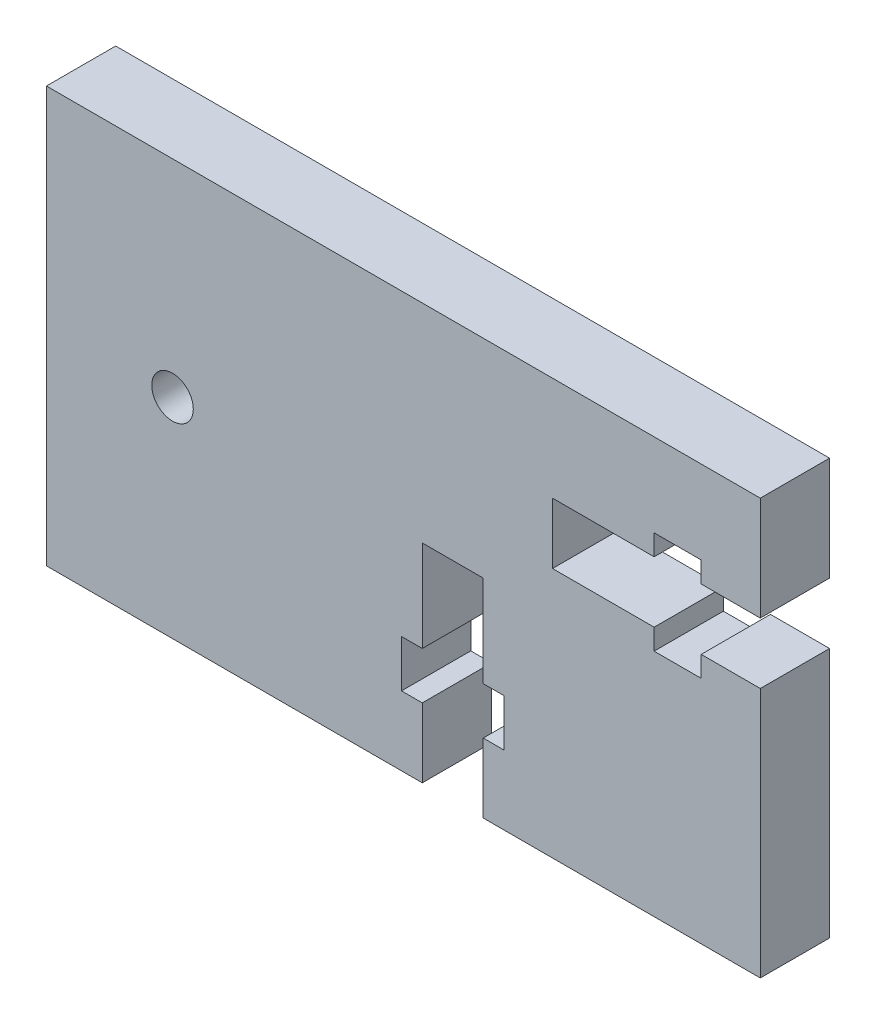
ISO-10303-21;
HEADER;
FILE_DESCRIPTION(('STEP AP214'),'2;1');
FILE_NAME('part.step','',(''),(''),'','','');
FILE_SCHEMA(('AUTOMOTIVE_DESIGN { 1 0 10303 214 1 1 1 1 }'));
ENDSEC;
DATA;
#1=APPLICATION_CONTEXT('core data for automotive mechanical design processes');
#2=APPLICATION_PROTOCOL_DEFINITION('international standard','automotive_design',2000,#1);
#3=PRODUCT_CONTEXT('',#1,'mechanical');
#4=PRODUCT('Part','Part','',(#3));
#5=PRODUCT_RELATED_PRODUCT_CATEGORY('part','',(#4));
#6=PRODUCT_DEFINITION_FORMATION('','',#4);
#7=PRODUCT_DEFINITION_CONTEXT('part definition',#1,'design');
#8=PRODUCT_DEFINITION('design','',#6,#7);
#9=PRODUCT_DEFINITION_SHAPE('','',#8);
#10=(LENGTH_UNIT() NAMED_UNIT(*) SI_UNIT(.MILLI.,.METRE.));
#11=(NAMED_UNIT(*) PLANE_ANGLE_UNIT() SI_UNIT($,.RADIAN.));
#12=(NAMED_UNIT(*) SI_UNIT($,.STERADIAN.) SOLID_ANGLE_UNIT());
#13=UNCERTAINTY_MEASURE_WITH_UNIT(LENGTH_MEASURE(1.E-05),#10,'distance_accuracy_value','');
#14=(GEOMETRIC_REPRESENTATION_CONTEXT(3) GLOBAL_UNCERTAINTY_ASSIGNED_CONTEXT((#13)) GLOBAL_UNIT_ASSIGNED_CONTEXT((#10,
#11,#12)) REPRESENTATION_CONTEXT('',''));
#15=CARTESIAN_POINT('',(0.,0.,0.));
#16=DIRECTION('',(0.,0.,1.));
#17=DIRECTION('',(1.,0.,0.));
#18=AXIS2_PLACEMENT_3D('',#15,#16,#17);
#19=CARTESIAN_POINT('',(-23.,-20.,5.));
#20=DIRECTION('',(0.,1.,0.));
#21=DIRECTION('',(0.,0.,1.));
#22=AXIS2_PLACEMENT_3D('',#19,#20,#21);
#23=PLANE('',#22);
#24=DIRECTION('',(1.,0.,0.));
#25=VECTOR('',#24,1.);
#26=CARTESIAN_POINT('',(-23.,-20.,5.));
#27=LINE('',#26,#25);
#28=CARTESIAN_POINT('',(8.53000000000001,-20.,5.));
#29=VERTEX_POINT('',#28);
#30=CARTESIAN_POINT('',(28.53,-20.,5.));
#31=VERTEX_POINT('',#30);
#32=EDGE_CURVE('E411',#29,#31,#27,.T.);
#33=ORIENTED_EDGE('',*,*,#32,.F.);
#34=DIRECTION('',(0.,0.,1.));
#35=VECTOR('',#34,1.);
#36=CARTESIAN_POINT('',(8.53000000000001,-20.,0.));
#37=LINE('',#36,#35);
#38=CARTESIAN_POINT('',(8.53000000000001,-20.,0.));
#39=VERTEX_POINT('',#38);
#40=EDGE_CURVE('E394',#39,#29,#37,.T.);
#41=ORIENTED_EDGE('',*,*,#40,.F.);
#42=DIRECTION('',(1.,0.,0.));
#43=VECTOR('',#42,1.);
#44=CARTESIAN_POINT('',(-23.,-20.,0.));
#45=LINE('',#44,#43);
#46=CARTESIAN_POINT('',(28.53,-20.,0.));
#47=VERTEX_POINT('',#46);
#48=EDGE_CURVE('E425',#39,#47,#45,.T.);
#49=ORIENTED_EDGE('',*,*,#48,.T.);
#50=DIRECTION('',(0.,0.,-1.));
#51=VECTOR('',#50,1.);
#52=CARTESIAN_POINT('',(28.53,-20.,5.));
#53=LINE('',#52,#51);
#54=EDGE_CURVE('E40',#31,#47,#53,.T.);
#55=ORIENTED_EDGE('',*,*,#54,.F.);
#56=EDGE_LOOP('',(#33,#41,#49,#55));
#57=FACE_BOUND('',#56,.T.);
#58=ADVANCED_FACE('F32',(#57),#23,.F.);
#59=CARTESIAN_POINT('',(28.53,10.,5.));
#60=DIRECTION('',(-1.,0.,0.));
#61=DIRECTION('',(0.,-1.,0.));
#62=AXIS2_PLACEMENT_3D('',#59,#60,#61);
#63=PLANE('',#62);
#64=DIRECTION('',(0.,1.,0.));
#65=VECTOR('',#64,1.);
#66=CARTESIAN_POINT('',(28.53,10.,5.));
#67=LINE('',#66,#65);
#68=CARTESIAN_POINT('',(28.53,2.5,5.));
#69=VERTEX_POINT('',#68);
#70=CARTESIAN_POINT('',(28.53,10.,5.));
#71=VERTEX_POINT('',#70);
#72=EDGE_CURVE('E416',#69,#71,#67,.T.);
#73=ORIENTED_EDGE('',*,*,#72,.F.);
#74=DIRECTION('',(0.,0.,1.));
#75=VECTOR('',#74,1.);
#76=CARTESIAN_POINT('',(28.53,2.5,0.));
#77=LINE('',#76,#75);
#78=CARTESIAN_POINT('',(28.53,2.5,0.));
#79=VERTEX_POINT('',#78);
#80=EDGE_CURVE('E308',#79,#69,#77,.T.);
#81=ORIENTED_EDGE('',*,*,#80,.F.);
#82=DIRECTION('',(0.,1.,0.));
#83=VECTOR('',#82,1.);
#84=CARTESIAN_POINT('',(28.53,10.,0.));
#85=LINE('',#84,#83);
#86=CARTESIAN_POINT('',(28.53,10.,0.));
#87=VERTEX_POINT('',#86);
#88=EDGE_CURVE('E429',#79,#87,#85,.T.);
#89=ORIENTED_EDGE('',*,*,#88,.T.);
#90=DIRECTION('',(0.,0.,-1.));
#91=VECTOR('',#90,1.);
#92=CARTESIAN_POINT('',(28.53,10.,5.));
#93=LINE('',#92,#91);
#94=EDGE_CURVE('E436',#71,#87,#93,.T.);
#95=ORIENTED_EDGE('',*,*,#94,.F.);
#96=EDGE_LOOP('',(#73,#81,#89,#95));
#97=FACE_BOUND('',#96,.T.);
#98=ADVANCED_FACE('F510',(#97),#63,.F.);
#99=CARTESIAN_POINT('',(-23.,10.,5.));
#100=DIRECTION('',(1.,0.,0.));
#101=DIRECTION('',(0.,1.,0.));
#102=AXIS2_PLACEMENT_3D('',#99,#100,#101);
#103=PLANE('',#102);
#104=DIRECTION('',(0.,-1.,0.));
#105=VECTOR('',#104,1.);
#106=CARTESIAN_POINT('',(-23.,10.,0.));
#107=LINE('',#106,#105);
#108=CARTESIAN_POINT('',(-23.,10.,0.));
#109=VERTEX_POINT('',#108);
#110=CARTESIAN_POINT('',(-23.,-20.,0.));
#111=VERTEX_POINT('',#110);
#112=EDGE_CURVE('E299',#109,#111,#107,.T.);
#113=ORIENTED_EDGE('',*,*,#112,.T.);
#114=DIRECTION('',(0.,0.,-1.));
#115=VECTOR('',#114,1.);
#116=CARTESIAN_POINT('',(-23.,-20.,5.));
#117=LINE('',#116,#115);
#118=CARTESIAN_POINT('',(-23.,-20.,5.));
#119=VERTEX_POINT('',#118);
#120=EDGE_CURVE('E11',#119,#111,#117,.T.);
#121=ORIENTED_EDGE('',*,*,#120,.F.);
#122=DIRECTION('',(0.,-1.,0.));
#123=VECTOR('',#122,1.);
#124=CARTESIAN_POINT('',(-23.,10.,5.));
#125=LINE('',#124,#123);
#126=CARTESIAN_POINT('',(-23.,10.,5.));
#127=VERTEX_POINT('',#126);
#128=EDGE_CURVE('E408',#127,#119,#125,.T.);
#129=ORIENTED_EDGE('',*,*,#128,.F.);
#130=DIRECTION('',(0.,0.,-1.));
#131=VECTOR('',#130,1.);
#132=CARTESIAN_POINT('',(-23.,10.,5.));
#133=LINE('',#132,#131);
#134=EDGE_CURVE('E422',#127,#109,#133,.T.);
#135=ORIENTED_EDGE('',*,*,#134,.T.);
#136=EDGE_LOOP('',(#113,#121,#129,#135));
#137=FACE_BOUND('',#136,.T.);
#138=ADVANCED_FACE('F34',(#137),#103,.F.);
#139=CARTESIAN_POINT('',(4.13000000000001,-20.,0.));
#140=VERTEX_POINT('',#139);
#141=EDGE_CURVE('E426',#111,#140,#45,.T.);
#142=ORIENTED_EDGE('',*,*,#141,.T.);
#143=DIRECTION('',(0.,0.,1.));
#144=VECTOR('',#143,1.);
#145=CARTESIAN_POINT('',(4.13000000000001,-20.,0.));
#146=LINE('',#145,#144);
#147=CARTESIAN_POINT('',(4.13000000000001,-20.,5.));
#148=VERTEX_POINT('',#147);
#149=EDGE_CURVE('E396',#140,#148,#146,.T.);
#150=ORIENTED_EDGE('',*,*,#149,.T.);
#151=EDGE_CURVE('E413',#119,#148,#27,.T.);
#152=ORIENTED_EDGE('',*,*,#151,.F.);
#153=ORIENTED_EDGE('',*,*,#120,.T.);
#154=EDGE_LOOP('',(#142,#150,#152,#153));
#155=FACE_BOUND('',#154,.T.);
#156=ADVANCED_FACE('F498',(#155),#23,.F.);
#157=CARTESIAN_POINT('',(28.53,-1.9,0.));
#158=VERTEX_POINT('',#157);
#159=EDGE_CURVE('E430',#47,#158,#85,.T.);
#160=ORIENTED_EDGE('',*,*,#159,.T.);
#161=DIRECTION('',(0.,0.,1.));
#162=VECTOR('',#161,1.);
#163=CARTESIAN_POINT('',(28.53,-1.9,0.));
#164=LINE('',#163,#162);
#165=CARTESIAN_POINT('',(28.53,-1.9,5.));
#166=VERTEX_POINT('',#165);
#167=EDGE_CURVE('E310',#158,#166,#164,.T.);
#168=ORIENTED_EDGE('',*,*,#167,.T.);
#169=EDGE_CURVE('E417',#31,#166,#67,.T.);
#170=ORIENTED_EDGE('',*,*,#169,.F.);
#171=ORIENTED_EDGE('',*,*,#54,.T.);
#172=EDGE_LOOP('',(#160,#168,#170,#171));
#173=FACE_BOUND('',#172,.T.);
#174=ADVANCED_FACE('F443',(#173),#63,.F.);
#175=CARTESIAN_POINT('',(-23.,10.,5.));
#176=DIRECTION('',(0.,-1.,0.));
#177=DIRECTION('',(1.,0.,0.));
#178=AXIS2_PLACEMENT_3D('',#175,#176,#177);
#179=PLANE('',#178);
#180=DIRECTION('',(-1.,0.,0.));
#181=VECTOR('',#180,1.);
#182=CARTESIAN_POINT('',(-23.,10.,0.));
#183=LINE('',#182,#181);
#184=EDGE_CURVE('E412',#87,#109,#183,.T.);
#185=ORIENTED_EDGE('',*,*,#184,.T.);
#186=ORIENTED_EDGE('',*,*,#134,.F.);
#187=DIRECTION('',(-1.,0.,0.));
#188=VECTOR('',#187,1.);
#189=CARTESIAN_POINT('',(-23.,10.,5.));
#190=LINE('',#189,#188);
#191=EDGE_CURVE('E420',#71,#127,#190,.T.);
#192=ORIENTED_EDGE('',*,*,#191,.F.);
#193=ORIENTED_EDGE('',*,*,#94,.T.);
#194=EDGE_LOOP('',(#185,#186,#192,#193));
#195=FACE_BOUND('',#194,.T.);
#196=ADVANCED_FACE('F505',(#195),#179,.F.);
#197=CARTESIAN_POINT('',(0.,0.,5.));
#198=DIRECTION('',(0.,0.,1.));
#199=DIRECTION('',(1.,0.,0.));
#200=AXIS2_PLACEMENT_3D('',#197,#198,#199);
#201=PLANE('',#200);
#202=CARTESIAN_POINT('',(-13.8996163089437,-4.90362405937177,5.));
#203=DIRECTION('',(0.,0.,1.));
#204=DIRECTION('',(1.,0.,0.));
#205=AXIS2_PLACEMENT_3D('',#202,#203,#204);
#206=CIRCLE('',#205,1.5);
#207=CARTESIAN_POINT('',(-12.3996163089437,-4.90362405937177,5.));
#208=VERTEX_POINT('',#207);
#209=EDGE_CURVE('E246',#208,#208,#206,.T.);
#210=ORIENTED_EDGE('',*,*,#209,.F.);
#211=EDGE_LOOP('',(#210));
#212=FACE_BOUND('',#211,.T.);
#213=DIRECTION('',(-1.,0.,0.));
#214=VECTOR('',#213,1.);
#215=CARTESIAN_POINT('',(28.53,2.5,5.));
#216=LINE('',#215,#214);
#217=CARTESIAN_POINT('',(24.2659048732177,2.5,5.));
#218=VERTEX_POINT('',#217);
#219=EDGE_CURVE('E286',#69,#218,#216,.T.);
#220=ORIENTED_EDGE('',*,*,#219,.F.);
#221=ORIENTED_EDGE('',*,*,#72,.T.);
#222=ORIENTED_EDGE('',*,*,#191,.T.);
#223=ORIENTED_EDGE('',*,*,#128,.T.);
#224=ORIENTED_EDGE('',*,*,#151,.T.);
#225=DIRECTION('',(0.,-1.,0.));
#226=VECTOR('',#225,1.);
#227=CARTESIAN_POINT('',(4.13000000000001,-15.,5.));
#228=LINE('',#227,#226);
#229=CARTESIAN_POINT('',(4.13000000000001,-15.,5.));
#230=VERTEX_POINT('',#229);
#231=EDGE_CURVE('E369',#230,#148,#228,.T.);
#232=ORIENTED_EDGE('',*,*,#231,.F.);
#233=DIRECTION('',(1.,0.,0.));
#234=VECTOR('',#233,1.);
#235=CARTESIAN_POINT('',(2.63000000000001,-15.,5.));
#236=LINE('',#235,#234);
#237=CARTESIAN_POINT('',(2.63000000000001,-15.,5.));
#238=VERTEX_POINT('',#237);
#239=EDGE_CURVE('E366',#238,#230,#236,.T.);
#240=ORIENTED_EDGE('',*,*,#239,.F.);
#241=DIRECTION('',(0.,-1.,0.));
#242=VECTOR('',#241,1.);
#243=CARTESIAN_POINT('',(2.63,-11.6,5.));
#244=LINE('',#243,#242);
#245=CARTESIAN_POINT('',(2.63,-11.6,5.));
#246=VERTEX_POINT('',#245);
#247=EDGE_CURVE('E363',#246,#238,#244,.T.);
#248=ORIENTED_EDGE('',*,*,#247,.F.);
#249=DIRECTION('',(-1.,0.,0.));
#250=VECTOR('',#249,1.);
#251=CARTESIAN_POINT('',(4.13000000000001,-11.6,5.));
#252=LINE('',#251,#250);
#253=CARTESIAN_POINT('',(4.13000000000001,-11.6,5.));
#254=VERTEX_POINT('',#253);
#255=EDGE_CURVE('E360',#254,#246,#252,.T.);
#256=ORIENTED_EDGE('',*,*,#255,.F.);
#257=DIRECTION('',(0.,-1.,0.));
#258=VECTOR('',#257,1.);
#259=CARTESIAN_POINT('',(4.13000000000001,-5.,5.));
#260=LINE('',#259,#258);
#261=CARTESIAN_POINT('',(4.13000000000001,-5.,5.));
#262=VERTEX_POINT('',#261);
#263=EDGE_CURVE('E356',#262,#254,#260,.T.);
#264=ORIENTED_EDGE('',*,*,#263,.F.);
#265=DIRECTION('',(-1.,0.,0.));
#266=VECTOR('',#265,1.);
#267=CARTESIAN_POINT('',(4.13000000000001,-5.,5.));
#268=LINE('',#267,#266);
#269=CARTESIAN_POINT('',(8.53000000000001,-5.,5.));
#270=VERTEX_POINT('',#269);
#271=EDGE_CURVE('E353',#270,#262,#268,.T.);
#272=ORIENTED_EDGE('',*,*,#271,.F.);
#273=DIRECTION('',(0.,1.,0.));
#274=VECTOR('',#273,1.);
#275=CARTESIAN_POINT('',(8.53000000000001,-11.6,5.));
#276=LINE('',#275,#274);
#277=CARTESIAN_POINT('',(8.53000000000001,-11.6,5.));
#278=VERTEX_POINT('',#277);
#279=EDGE_CURVE('E324',#278,#270,#276,.T.);
#280=ORIENTED_EDGE('',*,*,#279,.F.);
#281=DIRECTION('',(-1.,0.,0.));
#282=VECTOR('',#281,1.);
#283=CARTESIAN_POINT('',(8.53000000000001,-11.6,5.));
#284=LINE('',#283,#282);
#285=CARTESIAN_POINT('',(10.03,-11.6,5.));
#286=VERTEX_POINT('',#285);
#287=EDGE_CURVE('E380',#286,#278,#284,.T.);
#288=ORIENTED_EDGE('',*,*,#287,.F.);
#289=DIRECTION('',(0.,1.,0.));
#290=VECTOR('',#289,1.);
#291=CARTESIAN_POINT('',(10.03,-11.6,5.));
#292=LINE('',#291,#290);
#293=CARTESIAN_POINT('',(10.03,-15.,5.));
#294=VERTEX_POINT('',#293);
#295=EDGE_CURVE('E377',#294,#286,#292,.T.);
#296=ORIENTED_EDGE('',*,*,#295,.F.);
#297=DIRECTION('',(1.,0.,0.));
#298=VECTOR('',#297,1.);
#299=CARTESIAN_POINT('',(10.03,-15.,5.));
#300=LINE('',#299,#298);
#301=CARTESIAN_POINT('',(8.53000000000001,-15.,5.));
#302=VERTEX_POINT('',#301);
#303=EDGE_CURVE('E374',#302,#294,#300,.T.);
#304=ORIENTED_EDGE('',*,*,#303,.F.);
#305=DIRECTION('',(0.,1.,0.));
#306=VECTOR('',#305,1.);
#307=CARTESIAN_POINT('',(8.53000000000001,-20.,5.));
#308=LINE('',#307,#306);
#309=EDGE_CURVE('E371',#29,#302,#308,.T.);
#310=ORIENTED_EDGE('',*,*,#309,.F.);
#311=ORIENTED_EDGE('',*,*,#32,.T.);
#312=ORIENTED_EDGE('',*,*,#169,.T.);
#313=DIRECTION('',(1.,0.,0.));
#314=VECTOR('',#313,1.);
#315=CARTESIAN_POINT('',(24.2659048732177,-1.9,5.));
#316=LINE('',#315,#314);
#317=CARTESIAN_POINT('',(24.2659048732177,-1.9,5.));
#318=VERTEX_POINT('',#317);
#319=EDGE_CURVE('E284',#318,#166,#316,.T.);
#320=ORIENTED_EDGE('',*,*,#319,.F.);
#321=DIRECTION('',(0.,1.,0.));
#322=VECTOR('',#321,1.);
#323=CARTESIAN_POINT('',(24.2659048732177,-3.4,5.));
#324=LINE('',#323,#322);
#325=CARTESIAN_POINT('',(24.2659048732177,-3.4,5.));
#326=VERTEX_POINT('',#325);
#327=EDGE_CURVE('E281',#326,#318,#324,.T.);
#328=ORIENTED_EDGE('',*,*,#327,.F.);
#329=DIRECTION('',(1.,0.,0.));
#330=VECTOR('',#329,1.);
#331=CARTESIAN_POINT('',(20.8659048732177,-3.4,5.));
#332=LINE('',#331,#330);
#333=CARTESIAN_POINT('',(20.8659048732177,-3.4,5.));
#334=VERTEX_POINT('',#333);
#335=EDGE_CURVE('E278',#334,#326,#332,.T.);
#336=ORIENTED_EDGE('',*,*,#335,.F.);
#337=DIRECTION('',(0.,-1.,0.));
#338=VECTOR('',#337,1.);
#339=CARTESIAN_POINT('',(20.8659048732177,-1.9,5.));
#340=LINE('',#339,#338);
#341=CARTESIAN_POINT('',(20.8659048732177,-1.9,5.));
#342=VERTEX_POINT('',#341);
#343=EDGE_CURVE('E275',#342,#334,#340,.T.);
#344=ORIENTED_EDGE('',*,*,#343,.F.);
#345=DIRECTION('',(1.,0.,0.));
#346=VECTOR('',#345,1.);
#347=CARTESIAN_POINT('',(13.53,-1.9,5.));
#348=LINE('',#347,#346);
#349=CARTESIAN_POINT('',(13.53,-1.9,5.));
#350=VERTEX_POINT('',#349);
#351=EDGE_CURVE('E272',#350,#342,#348,.T.);
#352=ORIENTED_EDGE('',*,*,#351,.F.);
#353=DIRECTION('',(0.,-1.,0.));
#354=VECTOR('',#353,1.);
#355=CARTESIAN_POINT('',(13.53,-1.9,5.));
#356=LINE('',#355,#354);
#357=CARTESIAN_POINT('',(13.53,2.5,5.));
#358=VERTEX_POINT('',#357);
#359=EDGE_CURVE('E224',#358,#350,#356,.T.);
#360=ORIENTED_EDGE('',*,*,#359,.F.);
#361=DIRECTION('',(-1.,0.,0.));
#362=VECTOR('',#361,1.);
#363=CARTESIAN_POINT('',(20.8659048732177,2.5,5.));
#364=LINE('',#363,#362);
#365=CARTESIAN_POINT('',(20.8659048732177,2.5,5.));
#366=VERTEX_POINT('',#365);
#367=EDGE_CURVE('E240',#366,#358,#364,.T.);
#368=ORIENTED_EDGE('',*,*,#367,.F.);
#369=DIRECTION('',(0.,-1.,0.));
#370=VECTOR('',#369,1.);
#371=CARTESIAN_POINT('',(20.8659048732177,2.5,5.));
#372=LINE('',#371,#370);
#373=CARTESIAN_POINT('',(20.8659048732177,4.,5.));
#374=VERTEX_POINT('',#373);
#375=EDGE_CURVE('E243',#374,#366,#372,.T.);
#376=ORIENTED_EDGE('',*,*,#375,.F.);
#377=DIRECTION('',(-1.,0.,0.));
#378=VECTOR('',#377,1.);
#379=CARTESIAN_POINT('',(20.8659048732177,4.,5.));
#380=LINE('',#379,#378);
#381=CARTESIAN_POINT('',(24.2659048732177,4.00000000000001,5.));
#382=VERTEX_POINT('',#381);
#383=EDGE_CURVE('E292',#382,#374,#380,.T.);
#384=ORIENTED_EDGE('',*,*,#383,.F.);
#385=DIRECTION('',(0.,1.,0.));
#386=VECTOR('',#385,1.);
#387=CARTESIAN_POINT('',(24.2659048732177,4.00000000000001,5.));
#388=LINE('',#387,#386);
#389=EDGE_CURVE('E289',#218,#382,#388,.T.);
#390=ORIENTED_EDGE('',*,*,#389,.F.);
#391=EDGE_LOOP('',(#220,#221,#222,#223,#224,#232,#240,#248,#256,#264,#272,#280,#288,#296,#304,
#310,#311,#312,#320,#328,#336,#344,#352,#360,#368,#376,#384,#390));
#392=FACE_BOUND('',#391,.T.);
#393=ADVANCED_FACE('F454',(#212,#392),#201,.T.);
#394=CARTESIAN_POINT('',(0.,0.,0.));
#395=DIRECTION('',(0.,0.,1.));
#396=DIRECTION('',(1.,0.,0.));
#397=AXIS2_PLACEMENT_3D('',#394,#395,#396);
#398=PLANE('',#397);
#399=CARTESIAN_POINT('',(-13.8996163089437,-4.90362405937177,0.));
#400=DIRECTION('',(0.,0.,1.));
#401=DIRECTION('',(1.,0.,0.));
#402=AXIS2_PLACEMENT_3D('',#399,#400,#401);
#403=CIRCLE('',#402,1.5);
#404=CARTESIAN_POINT('',(-12.3996163089437,-4.90362405937177,0.));
#405=VERTEX_POINT('',#404);
#406=EDGE_CURVE('E357',#405,#405,#403,.T.);
#407=ORIENTED_EDGE('',*,*,#406,.T.);
#408=EDGE_LOOP('',(#407));
#409=FACE_BOUND('',#408,.T.);
#410=ORIENTED_EDGE('',*,*,#88,.F.);
#411=DIRECTION('',(-1.,0.,0.));
#412=VECTOR('',#411,1.);
#413=CARTESIAN_POINT('',(28.53,2.5,0.));
#414=LINE('',#413,#412);
#415=CARTESIAN_POINT('',(24.2659048732177,2.5,0.));
#416=VERTEX_POINT('',#415);
#417=EDGE_CURVE('E259',#79,#416,#414,.T.);
#418=ORIENTED_EDGE('',*,*,#417,.T.);
#419=DIRECTION('',(0.,1.,0.));
#420=VECTOR('',#419,1.);
#421=CARTESIAN_POINT('',(24.2659048732177,4.00000000000001,0.));
#422=LINE('',#421,#420);
#423=CARTESIAN_POINT('',(24.2659048732177,4.00000000000001,0.));
#424=VERTEX_POINT('',#423);
#425=EDGE_CURVE('E262',#416,#424,#422,.T.);
#426=ORIENTED_EDGE('',*,*,#425,.T.);
#427=DIRECTION('',(-1.,0.,0.));
#428=VECTOR('',#427,1.);
#429=CARTESIAN_POINT('',(20.8659048732177,4.,0.));
#430=LINE('',#429,#428);
#431=CARTESIAN_POINT('',(20.8659048732177,4.,0.));
#432=VERTEX_POINT('',#431);
#433=EDGE_CURVE('E265',#424,#432,#430,.T.);
#434=ORIENTED_EDGE('',*,*,#433,.T.);
#435=DIRECTION('',(0.,-1.,0.));
#436=VECTOR('',#435,1.);
#437=CARTESIAN_POINT('',(20.8659048732177,2.5,0.));
#438=LINE('',#437,#436);
#439=CARTESIAN_POINT('',(20.8659048732177,2.5,0.));
#440=VERTEX_POINT('',#439);
#441=EDGE_CURVE('E268',#432,#440,#438,.T.);
#442=ORIENTED_EDGE('',*,*,#441,.T.);
#443=DIRECTION('',(-1.,0.,0.));
#444=VECTOR('',#443,1.);
#445=CARTESIAN_POINT('',(20.8659048732177,2.5,0.));
#446=LINE('',#445,#444);
#447=CARTESIAN_POINT('',(13.53,2.5,0.));
#448=VERTEX_POINT('',#447);
#449=EDGE_CURVE('E229',#440,#448,#446,.T.);
#450=ORIENTED_EDGE('',*,*,#449,.T.);
#451=DIRECTION('',(0.,-1.,0.));
#452=VECTOR('',#451,1.);
#453=CARTESIAN_POINT('',(13.53,-1.9,0.));
#454=LINE('',#453,#452);
#455=CARTESIAN_POINT('',(13.53,-1.9,0.));
#456=VERTEX_POINT('',#455);
#457=EDGE_CURVE('E221',#448,#456,#454,.T.);
#458=ORIENTED_EDGE('',*,*,#457,.T.);
#459=DIRECTION('',(1.,0.,0.));
#460=VECTOR('',#459,1.);
#461=CARTESIAN_POINT('',(13.53,-1.9,0.));
#462=LINE('',#461,#460);
#463=CARTESIAN_POINT('',(20.8659048732177,-1.9,0.));
#464=VERTEX_POINT('',#463);
#465=EDGE_CURVE('E232',#456,#464,#462,.T.);
#466=ORIENTED_EDGE('',*,*,#465,.T.);
#467=DIRECTION('',(0.,-1.,0.));
#468=VECTOR('',#467,1.);
#469=CARTESIAN_POINT('',(20.8659048732177,-1.9,0.));
#470=LINE('',#469,#468);
#471=CARTESIAN_POINT('',(20.8659048732177,-3.4,0.));
#472=VERTEX_POINT('',#471);
#473=EDGE_CURVE('E47',#464,#472,#470,.T.);
#474=ORIENTED_EDGE('',*,*,#473,.T.);
#475=DIRECTION('',(1.,0.,0.));
#476=VECTOR('',#475,1.);
#477=CARTESIAN_POINT('',(20.8659048732177,-3.4,0.));
#478=LINE('',#477,#476);
#479=CARTESIAN_POINT('',(24.2659048732177,-3.4,0.));
#480=VERTEX_POINT('',#479);
#481=EDGE_CURVE('E250',#472,#480,#478,.T.);
#482=ORIENTED_EDGE('',*,*,#481,.T.);
#483=DIRECTION('',(0.,1.,0.));
#484=VECTOR('',#483,1.);
#485=CARTESIAN_POINT('',(24.2659048732177,-3.4,0.));
#486=LINE('',#485,#484);
#487=CARTESIAN_POINT('',(24.2659048732177,-1.9,0.));
#488=VERTEX_POINT('',#487);
#489=EDGE_CURVE('E253',#480,#488,#486,.T.);
#490=ORIENTED_EDGE('',*,*,#489,.T.);
#491=DIRECTION('',(1.,0.,0.));
#492=VECTOR('',#491,1.);
#493=CARTESIAN_POINT('',(24.2659048732177,-1.9,0.));
#494=LINE('',#493,#492);
#495=EDGE_CURVE('E256',#488,#158,#494,.T.);
#496=ORIENTED_EDGE('',*,*,#495,.T.);
#497=ORIENTED_EDGE('',*,*,#159,.F.);
#498=ORIENTED_EDGE('',*,*,#48,.F.);
#499=DIRECTION('',(0.,1.,0.));
#500=VECTOR('',#499,1.);
#501=CARTESIAN_POINT('',(8.53000000000001,-20.,0.));
#502=LINE('',#501,#500);
#503=CARTESIAN_POINT('',(8.53000000000001,-15.,0.));
#504=VERTEX_POINT('',#503);
#505=EDGE_CURVE('E337',#39,#504,#502,.T.);
#506=ORIENTED_EDGE('',*,*,#505,.T.);
#507=DIRECTION('',(1.,0.,0.));
#508=VECTOR('',#507,1.);
#509=CARTESIAN_POINT('',(10.03,-15.,0.));
#510=LINE('',#509,#508);
#511=CARTESIAN_POINT('',(10.03,-15.,0.));
#512=VERTEX_POINT('',#511);
#513=EDGE_CURVE('E340',#504,#512,#510,.T.);
#514=ORIENTED_EDGE('',*,*,#513,.T.);
#515=DIRECTION('',(0.,1.,0.));
#516=VECTOR('',#515,1.);
#517=CARTESIAN_POINT('',(10.03,-11.6,0.));
#518=LINE('',#517,#516);
#519=CARTESIAN_POINT('',(10.03,-11.6,0.));
#520=VERTEX_POINT('',#519);
#521=EDGE_CURVE('E343',#512,#520,#518,.T.);
#522=ORIENTED_EDGE('',*,*,#521,.T.);
#523=DIRECTION('',(-1.,0.,0.));
#524=VECTOR('',#523,1.);
#525=CARTESIAN_POINT('',(8.53000000000001,-11.6,0.));
#526=LINE('',#525,#524);
#527=CARTESIAN_POINT('',(8.53000000000001,-11.6,0.));
#528=VERTEX_POINT('',#527);
#529=EDGE_CURVE('E346',#520,#528,#526,.T.);
#530=ORIENTED_EDGE('',*,*,#529,.T.);
#531=DIRECTION('',(0.,1.,0.));
#532=VECTOR('',#531,1.);
#533=CARTESIAN_POINT('',(8.53000000000001,-11.6,0.));
#534=LINE('',#533,#532);
#535=CARTESIAN_POINT('',(8.53000000000001,-5.,0.));
#536=VERTEX_POINT('',#535);
#537=EDGE_CURVE('E349',#528,#536,#534,.T.);
#538=ORIENTED_EDGE('',*,*,#537,.T.);
#539=DIRECTION('',(-1.,0.,0.));
#540=VECTOR('',#539,1.);
#541=CARTESIAN_POINT('',(4.13000000000001,-5.,0.));
#542=LINE('',#541,#540);
#543=CARTESIAN_POINT('',(4.13000000000001,-5.,0.));
#544=VERTEX_POINT('',#543);
#545=EDGE_CURVE('E320',#536,#544,#542,.T.);
#546=ORIENTED_EDGE('',*,*,#545,.T.);
#547=DIRECTION('',(0.,-1.,0.));
#548=VECTOR('',#547,1.);
#549=CARTESIAN_POINT('',(4.13000000000001,-5.,0.));
#550=LINE('',#549,#548);
#551=CARTESIAN_POINT('',(4.13000000000001,-11.6,0.));
#552=VERTEX_POINT('',#551);
#553=EDGE_CURVE('E323',#544,#552,#550,.T.);
#554=ORIENTED_EDGE('',*,*,#553,.T.);
#555=DIRECTION('',(-1.,0.,0.));
#556=VECTOR('',#555,1.);
#557=CARTESIAN_POINT('',(4.13000000000001,-11.6,0.));
#558=LINE('',#557,#556);
#559=CARTESIAN_POINT('',(2.63,-11.6,0.));
#560=VERTEX_POINT('',#559);
#561=EDGE_CURVE('E55',#552,#560,#558,.T.);
#562=ORIENTED_EDGE('',*,*,#561,.T.);
#563=DIRECTION('',(0.,-1.,0.));
#564=VECTOR('',#563,1.);
#565=CARTESIAN_POINT('',(2.63,-11.6,0.));
#566=LINE('',#565,#564);
#567=CARTESIAN_POINT('',(2.63000000000001,-15.,0.));
#568=VERTEX_POINT('',#567);
#569=EDGE_CURVE('E328',#560,#568,#566,.T.);
#570=ORIENTED_EDGE('',*,*,#569,.T.);
#571=DIRECTION('',(1.,0.,0.));
#572=VECTOR('',#571,1.);
#573=CARTESIAN_POINT('',(2.63000000000001,-15.,0.));
#574=LINE('',#573,#572);
#575=CARTESIAN_POINT('',(4.13000000000001,-15.,0.));
#576=VERTEX_POINT('',#575);
#577=EDGE_CURVE('E331',#568,#576,#574,.T.);
#578=ORIENTED_EDGE('',*,*,#577,.T.);
#579=DIRECTION('',(0.,-1.,0.));
#580=VECTOR('',#579,1.);
#581=CARTESIAN_POINT('',(4.13000000000001,-15.,0.));
#582=LINE('',#581,#580);
#583=EDGE_CURVE('E334',#576,#140,#582,.T.);
#584=ORIENTED_EDGE('',*,*,#583,.T.);
#585=ORIENTED_EDGE('',*,*,#141,.F.);
#586=ORIENTED_EDGE('',*,*,#112,.F.);
#587=ORIENTED_EDGE('',*,*,#184,.F.);
#588=EDGE_LOOP('',(#410,#418,#426,#434,#442,#450,#458,#466,#474,#482,#490,#496,#497,#498,#506,
#514,#522,#530,#538,#546,#554,#562,#570,#578,#584,#585,#586,#587));
#589=FACE_BOUND('',#588,.T.);
#590=ADVANCED_FACE('F237',(#409,#589),#398,.F.);
#591=CARTESIAN_POINT('',(4.13000000000001,-5.,0.));
#592=DIRECTION('',(0.,1.,0.));
#593=DIRECTION('',(0.,0.,1.));
#594=AXIS2_PLACEMENT_3D('',#591,#592,#593);
#595=PLANE('',#594);
#596=ORIENTED_EDGE('',*,*,#271,.T.);
#597=DIRECTION('',(0.,0.,1.));
#598=VECTOR('',#597,1.);
#599=CARTESIAN_POINT('',(4.13000000000001,-5.,0.));
#600=LINE('',#599,#598);
#601=EDGE_CURVE('E352',#544,#262,#600,.T.);
#602=ORIENTED_EDGE('',*,*,#601,.F.);
#603=ORIENTED_EDGE('',*,*,#545,.F.);
#604=DIRECTION('',(0.,0.,1.));
#605=VECTOR('',#604,1.);
#606=CARTESIAN_POINT('',(8.53000000000001,-5.,0.));
#607=LINE('',#606,#605);
#608=EDGE_CURVE('E273',#536,#270,#607,.T.);
#609=ORIENTED_EDGE('',*,*,#608,.T.);
#610=EDGE_LOOP('',(#596,#602,#603,#609));
#611=FACE_BOUND('',#610,.T.);
#612=ADVANCED_FACE('F479',(#611),#595,.F.);
#613=CARTESIAN_POINT('',(8.53000000000001,-11.6,0.));
#614=DIRECTION('',(1.,0.,0.));
#615=DIRECTION('',(0.,1.,0.));
#616=AXIS2_PLACEMENT_3D('',#613,#614,#615);
#617=PLANE('',#616);
#618=ORIENTED_EDGE('',*,*,#279,.T.);
#619=ORIENTED_EDGE('',*,*,#608,.F.);
#620=ORIENTED_EDGE('',*,*,#537,.F.);
#621=DIRECTION('',(0.,0.,1.));
#622=VECTOR('',#621,1.);
#623=CARTESIAN_POINT('',(8.53000000000001,-11.6,0.));
#624=LINE('',#623,#622);
#625=EDGE_CURVE('E386',#528,#278,#624,.T.);
#626=ORIENTED_EDGE('',*,*,#625,.T.);
#627=EDGE_LOOP('',(#618,#619,#620,#626));
#628=FACE_BOUND('',#627,.T.);
#629=ADVANCED_FACE('F475',(#628),#617,.F.);
#630=CARTESIAN_POINT('',(8.53000000000001,-11.6,0.));
#631=DIRECTION('',(0.,1.,0.));
#632=DIRECTION('',(0.,0.,1.));
#633=AXIS2_PLACEMENT_3D('',#630,#631,#632);
#634=PLANE('',#633);
#635=ORIENTED_EDGE('',*,*,#287,.T.);
#636=ORIENTED_EDGE('',*,*,#625,.F.);
#637=ORIENTED_EDGE('',*,*,#529,.F.);
#638=DIRECTION('',(0.,0.,1.));
#639=VECTOR('',#638,1.);
#640=CARTESIAN_POINT('',(10.03,-11.6,0.));
#641=LINE('',#640,#639);
#642=EDGE_CURVE('E388',#520,#286,#641,.T.);
#643=ORIENTED_EDGE('',*,*,#642,.T.);
#644=EDGE_LOOP('',(#635,#636,#637,#643));
#645=FACE_BOUND('',#644,.T.);
#646=ADVANCED_FACE('F471',(#645),#634,.F.);
#647=CARTESIAN_POINT('',(10.03,-11.6,0.));
#648=DIRECTION('',(1.,0.,0.));
#649=DIRECTION('',(0.,1.,0.));
#650=AXIS2_PLACEMENT_3D('',#647,#648,#649);
#651=PLANE('',#650);
#652=ORIENTED_EDGE('',*,*,#295,.T.);
#653=ORIENTED_EDGE('',*,*,#642,.F.);
#654=ORIENTED_EDGE('',*,*,#521,.F.);
#655=DIRECTION('',(0.,0.,1.));
#656=VECTOR('',#655,1.);
#657=CARTESIAN_POINT('',(10.03,-15.,0.));
#658=LINE('',#657,#656);
#659=EDGE_CURVE('E390',#512,#294,#658,.T.);
#660=ORIENTED_EDGE('',*,*,#659,.T.);
#661=EDGE_LOOP('',(#652,#653,#654,#660));
#662=FACE_BOUND('',#661,.T.);
#663=ADVANCED_FACE('F467',(#662),#651,.F.);
#664=CARTESIAN_POINT('',(10.03,-15.,0.));
#665=DIRECTION('',(0.,-1.,0.));
#666=DIRECTION('',(0.,0.,-1.));
#667=AXIS2_PLACEMENT_3D('',#664,#665,#666);
#668=PLANE('',#667);
#669=ORIENTED_EDGE('',*,*,#303,.T.);
#670=ORIENTED_EDGE('',*,*,#659,.F.);
#671=ORIENTED_EDGE('',*,*,#513,.F.);
#672=DIRECTION('',(0.,0.,1.));
#673=VECTOR('',#672,1.);
#674=CARTESIAN_POINT('',(8.53000000000001,-15.,0.));
#675=LINE('',#674,#673);
#676=EDGE_CURVE('E392',#504,#302,#675,.T.);
#677=ORIENTED_EDGE('',*,*,#676,.T.);
#678=EDGE_LOOP('',(#669,#670,#671,#677));
#679=FACE_BOUND('',#678,.T.);
#680=ADVANCED_FACE('F464',(#679),#668,.F.);
#681=CARTESIAN_POINT('',(8.53000000000001,-20.,0.));
#682=DIRECTION('',(1.,0.,0.));
#683=DIRECTION('',(0.,0.,-1.));
#684=AXIS2_PLACEMENT_3D('',#681,#682,#683);
#685=PLANE('',#684);
#686=ORIENTED_EDGE('',*,*,#309,.T.);
#687=ORIENTED_EDGE('',*,*,#676,.F.);
#688=ORIENTED_EDGE('',*,*,#505,.F.);
#689=ORIENTED_EDGE('',*,*,#40,.T.);
#690=EDGE_LOOP('',(#686,#687,#688,#689));
#691=FACE_BOUND('',#690,.T.);
#692=ADVANCED_FACE('F460',(#691),#685,.F.);
#693=CARTESIAN_POINT('',(4.13000000000001,-15.,0.));
#694=DIRECTION('',(-1.,0.,0.));
#695=DIRECTION('',(0.,-1.,0.));
#696=AXIS2_PLACEMENT_3D('',#693,#694,#695);
#697=PLANE('',#696);
#698=ORIENTED_EDGE('',*,*,#231,.T.);
#699=ORIENTED_EDGE('',*,*,#149,.F.);
#700=ORIENTED_EDGE('',*,*,#583,.F.);
#701=DIRECTION('',(0.,0.,1.));
#702=VECTOR('',#701,1.);
#703=CARTESIAN_POINT('',(4.13000000000001,-15.,0.));
#704=LINE('',#703,#702);
#705=EDGE_CURVE('E399',#576,#230,#704,.T.);
#706=ORIENTED_EDGE('',*,*,#705,.T.);
#707=EDGE_LOOP('',(#698,#699,#700,#706));
#708=FACE_BOUND('',#707,.T.);
#709=ADVANCED_FACE('F495',(#708),#697,.F.);
#710=CARTESIAN_POINT('',(2.63000000000001,-15.,0.));
#711=DIRECTION('',(0.,-1.,0.));
#712=DIRECTION('',(0.,0.,-1.));
#713=AXIS2_PLACEMENT_3D('',#710,#711,#712);
#714=PLANE('',#713);
#715=ORIENTED_EDGE('',*,*,#239,.T.);
#716=ORIENTED_EDGE('',*,*,#705,.F.);
#717=ORIENTED_EDGE('',*,*,#577,.F.);
#718=DIRECTION('',(0.,0.,1.));
#719=VECTOR('',#718,1.);
#720=CARTESIAN_POINT('',(2.63000000000001,-15.,0.));
#721=LINE('',#720,#719);
#722=EDGE_CURVE('E401',#568,#238,#721,.T.);
#723=ORIENTED_EDGE('',*,*,#722,.T.);
#724=EDGE_LOOP('',(#715,#716,#717,#723));
#725=FACE_BOUND('',#724,.T.);
#726=ADVANCED_FACE('F491',(#725),#714,.F.);
#727=CARTESIAN_POINT('',(2.63,-11.6,0.));
#728=DIRECTION('',(-1.,0.,0.));
#729=DIRECTION('',(0.,-1.,0.));
#730=AXIS2_PLACEMENT_3D('',#727,#728,#729);
#731=PLANE('',#730);
#732=ORIENTED_EDGE('',*,*,#247,.T.);
#733=ORIENTED_EDGE('',*,*,#722,.F.);
#734=ORIENTED_EDGE('',*,*,#569,.F.);
#735=DIRECTION('',(0.,0.,1.));
#736=VECTOR('',#735,1.);
#737=CARTESIAN_POINT('',(2.63,-11.6,0.));
#738=LINE('',#737,#736);
#739=EDGE_CURVE('E403',#560,#246,#738,.T.);
#740=ORIENTED_EDGE('',*,*,#739,.T.);
#741=EDGE_LOOP('',(#732,#733,#734,#740));
#742=FACE_BOUND('',#741,.T.);
#743=ADVANCED_FACE('F487',(#742),#731,.F.);
#744=CARTESIAN_POINT('',(4.13000000000001,-11.6,0.));
#745=DIRECTION('',(0.,1.,0.));
#746=DIRECTION('',(-1.,0.,0.));
#747=AXIS2_PLACEMENT_3D('',#744,#745,#746);
#748=PLANE('',#747);
#749=ORIENTED_EDGE('',*,*,#255,.T.);
#750=ORIENTED_EDGE('',*,*,#739,.F.);
#751=ORIENTED_EDGE('',*,*,#561,.F.);
#752=DIRECTION('',(0.,0.,1.));
#753=VECTOR('',#752,1.);
#754=CARTESIAN_POINT('',(4.13000000000001,-11.6,0.));
#755=LINE('',#754,#753);
#756=EDGE_CURVE('E405',#552,#254,#755,.T.);
#757=ORIENTED_EDGE('',*,*,#756,.T.);
#758=EDGE_LOOP('',(#749,#750,#751,#757));
#759=FACE_BOUND('',#758,.T.);
#760=ADVANCED_FACE('F651',(#759),#748,.F.);
#761=CARTESIAN_POINT('',(4.13000000000001,-5.,0.));
#762=DIRECTION('',(-1.,0.,0.));
#763=DIRECTION('',(0.,-1.,0.));
#764=AXIS2_PLACEMENT_3D('',#761,#762,#763);
#765=PLANE('',#764);
#766=ORIENTED_EDGE('',*,*,#263,.T.);
#767=ORIENTED_EDGE('',*,*,#756,.F.);
#768=ORIENTED_EDGE('',*,*,#553,.F.);
#769=ORIENTED_EDGE('',*,*,#601,.T.);
#770=EDGE_LOOP('',(#766,#767,#768,#769));
#771=FACE_BOUND('',#770,.T.);
#772=ADVANCED_FACE('F483',(#771),#765,.F.);
#773=CARTESIAN_POINT('',(13.53,-1.9,0.));
#774=DIRECTION('',(-1.,0.,0.));
#775=DIRECTION('',(0.,0.,1.));
#776=AXIS2_PLACEMENT_3D('',#773,#774,#775);
#777=PLANE('',#776);
#778=ORIENTED_EDGE('',*,*,#359,.T.);
#779=DIRECTION('',(0.,0.,1.));
#780=VECTOR('',#779,1.);
#781=CARTESIAN_POINT('',(13.53,-1.9,0.));
#782=LINE('',#781,#780);
#783=EDGE_CURVE('E217',#456,#350,#782,.T.);
#784=ORIENTED_EDGE('',*,*,#783,.F.);
#785=ORIENTED_EDGE('',*,*,#457,.F.);
#786=DIRECTION('',(0.,0.,1.));
#787=VECTOR('',#786,1.);
#788=CARTESIAN_POINT('',(13.53,2.5,0.));
#789=LINE('',#788,#787);
#790=EDGE_CURVE('E297',#448,#358,#789,.T.);
#791=ORIENTED_EDGE('',*,*,#790,.T.);
#792=EDGE_LOOP('',(#778,#784,#785,#791));
#793=FACE_BOUND('',#792,.T.);
#794=ADVANCED_FACE('F219',(#793),#777,.F.);
#795=CARTESIAN_POINT('',(20.8659048732177,2.5,0.));
#796=DIRECTION('',(0.,1.,0.));
#797=DIRECTION('',(0.,0.,1.));
#798=AXIS2_PLACEMENT_3D('',#795,#796,#797);
#799=PLANE('',#798);
#800=ORIENTED_EDGE('',*,*,#367,.T.);
#801=ORIENTED_EDGE('',*,*,#790,.F.);
#802=ORIENTED_EDGE('',*,*,#449,.F.);
#803=DIRECTION('',(0.,0.,1.));
#804=VECTOR('',#803,1.);
#805=CARTESIAN_POINT('',(20.8659048732177,2.5,0.));
#806=LINE('',#805,#804);
#807=EDGE_CURVE('E300',#440,#366,#806,.T.);
#808=ORIENTED_EDGE('',*,*,#807,.T.);
#809=EDGE_LOOP('',(#800,#801,#802,#808));
#810=FACE_BOUND('',#809,.T.);
#811=ADVANCED_FACE('F528',(#810),#799,.F.);
#812=CARTESIAN_POINT('',(20.8659048732177,2.5,0.));
#813=DIRECTION('',(-1.,0.,0.));
#814=DIRECTION('',(0.,0.,1.));
#815=AXIS2_PLACEMENT_3D('',#812,#813,#814);
#816=PLANE('',#815);
#817=ORIENTED_EDGE('',*,*,#375,.T.);
#818=ORIENTED_EDGE('',*,*,#807,.F.);
#819=ORIENTED_EDGE('',*,*,#441,.F.);
#820=DIRECTION('',(0.,0.,1.));
#821=VECTOR('',#820,1.);
#822=CARTESIAN_POINT('',(20.8659048732177,4.,0.));
#823=LINE('',#822,#821);
#824=EDGE_CURVE('E302',#432,#374,#823,.T.);
#825=ORIENTED_EDGE('',*,*,#824,.T.);
#826=EDGE_LOOP('',(#817,#818,#819,#825));
#827=FACE_BOUND('',#826,.T.);
#828=ADVANCED_FACE('F525',(#827),#816,.F.);
#829=CARTESIAN_POINT('',(20.8659048732177,4.,0.));
#830=DIRECTION('',(0.,1.,0.));
#831=DIRECTION('',(-1.,0.,0.));
#832=AXIS2_PLACEMENT_3D('',#829,#830,#831);
#833=PLANE('',#832);
#834=ORIENTED_EDGE('',*,*,#383,.T.);
#835=ORIENTED_EDGE('',*,*,#824,.F.);
#836=ORIENTED_EDGE('',*,*,#433,.F.);
#837=DIRECTION('',(0.,0.,1.));
#838=VECTOR('',#837,1.);
#839=CARTESIAN_POINT('',(24.2659048732177,4.00000000000001,0.));
#840=LINE('',#839,#838);
#841=EDGE_CURVE('E304',#424,#382,#840,.T.);
#842=ORIENTED_EDGE('',*,*,#841,.T.);
#843=EDGE_LOOP('',(#834,#835,#836,#842));
#844=FACE_BOUND('',#843,.T.);
#845=ADVANCED_FACE('F523',(#844),#833,.F.);
#846=CARTESIAN_POINT('',(24.2659048732177,4.00000000000001,0.));
#847=DIRECTION('',(1.,0.,0.));
#848=DIRECTION('',(0.,0.,-1.));
#849=AXIS2_PLACEMENT_3D('',#846,#847,#848);
#850=PLANE('',#849);
#851=ORIENTED_EDGE('',*,*,#389,.T.);
#852=ORIENTED_EDGE('',*,*,#841,.F.);
#853=ORIENTED_EDGE('',*,*,#425,.F.);
#854=DIRECTION('',(0.,0.,1.));
#855=VECTOR('',#854,1.);
#856=CARTESIAN_POINT('',(24.2659048732177,2.5,0.));
#857=LINE('',#856,#855);
#858=EDGE_CURVE('E306',#416,#218,#857,.T.);
#859=ORIENTED_EDGE('',*,*,#858,.T.);
#860=EDGE_LOOP('',(#851,#852,#853,#859));
#861=FACE_BOUND('',#860,.T.);
#862=ADVANCED_FACE('F518',(#861),#850,.F.);
#863=CARTESIAN_POINT('',(28.53,2.5,0.));
#864=DIRECTION('',(0.,1.,0.));
#865=DIRECTION('',(0.,0.,1.));
#866=AXIS2_PLACEMENT_3D('',#863,#864,#865);
#867=PLANE('',#866);
#868=ORIENTED_EDGE('',*,*,#219,.T.);
#869=ORIENTED_EDGE('',*,*,#858,.F.);
#870=ORIENTED_EDGE('',*,*,#417,.F.);
#871=ORIENTED_EDGE('',*,*,#80,.T.);
#872=EDGE_LOOP('',(#868,#869,#870,#871));
#873=FACE_BOUND('',#872,.T.);
#874=ADVANCED_FACE('F513',(#873),#867,.F.);
#875=CARTESIAN_POINT('',(24.2659048732177,-1.9,0.));
#876=DIRECTION('',(0.,-1.,0.));
#877=DIRECTION('',(1.,0.,0.));
#878=AXIS2_PLACEMENT_3D('',#875,#876,#877);
#879=PLANE('',#878);
#880=ORIENTED_EDGE('',*,*,#319,.T.);
#881=ORIENTED_EDGE('',*,*,#167,.F.);
#882=ORIENTED_EDGE('',*,*,#495,.F.);
#883=DIRECTION('',(0.,0.,1.));
#884=VECTOR('',#883,1.);
#885=CARTESIAN_POINT('',(24.2659048732177,-1.9,0.));
#886=LINE('',#885,#884);
#887=EDGE_CURVE('E313',#488,#318,#886,.T.);
#888=ORIENTED_EDGE('',*,*,#887,.T.);
#889=EDGE_LOOP('',(#880,#881,#882,#888));
#890=FACE_BOUND('',#889,.T.);
#891=ADVANCED_FACE('F450',(#890),#879,.F.);
#892=CARTESIAN_POINT('',(24.2659048732177,-3.4,0.));
#893=DIRECTION('',(1.,0.,0.));
#894=DIRECTION('',(0.,0.,-1.));
#895=AXIS2_PLACEMENT_3D('',#892,#893,#894);
#896=PLANE('',#895);
#897=ORIENTED_EDGE('',*,*,#327,.T.);
#898=ORIENTED_EDGE('',*,*,#887,.F.);
#899=ORIENTED_EDGE('',*,*,#489,.F.);
#900=DIRECTION('',(0.,0.,1.));
#901=VECTOR('',#900,1.);
#902=CARTESIAN_POINT('',(24.2659048732177,-3.4,0.));
#903=LINE('',#902,#901);
#904=EDGE_CURVE('E315',#480,#326,#903,.T.);
#905=ORIENTED_EDGE('',*,*,#904,.T.);
#906=EDGE_LOOP('',(#897,#898,#899,#905));
#907=FACE_BOUND('',#906,.T.);
#908=ADVANCED_FACE('F536',(#907),#896,.F.);
#909=CARTESIAN_POINT('',(20.8659048732177,-3.4,0.));
#910=DIRECTION('',(0.,-1.,0.));
#911=DIRECTION('',(1.,0.,0.));
#912=AXIS2_PLACEMENT_3D('',#909,#910,#911);
#913=PLANE('',#912);
#914=ORIENTED_EDGE('',*,*,#335,.T.);
#915=ORIENTED_EDGE('',*,*,#904,.F.);
#916=ORIENTED_EDGE('',*,*,#481,.F.);
#917=DIRECTION('',(0.,0.,1.));
#918=VECTOR('',#917,1.);
#919=CARTESIAN_POINT('',(20.8659048732177,-3.4,0.));
#920=LINE('',#919,#918);
#921=EDGE_CURVE('E317',#472,#334,#920,.T.);
#922=ORIENTED_EDGE('',*,*,#921,.T.);
#923=EDGE_LOOP('',(#914,#915,#916,#922));
#924=FACE_BOUND('',#923,.T.);
#925=ADVANCED_FACE('F534',(#924),#913,.F.);
#926=CARTESIAN_POINT('',(20.8659048732177,-1.9,0.));
#927=DIRECTION('',(-1.,0.,0.));
#928=DIRECTION('',(0.,0.,1.));
#929=AXIS2_PLACEMENT_3D('',#926,#927,#928);
#930=PLANE('',#929);
#931=ORIENTED_EDGE('',*,*,#343,.T.);
#932=ORIENTED_EDGE('',*,*,#921,.F.);
#933=ORIENTED_EDGE('',*,*,#473,.F.);
#934=DIRECTION('',(0.,0.,1.));
#935=VECTOR('',#934,1.);
#936=CARTESIAN_POINT('',(20.8659048732177,-1.9,0.));
#937=LINE('',#936,#935);
#938=EDGE_CURVE('E228',#464,#342,#937,.T.);
#939=ORIENTED_EDGE('',*,*,#938,.T.);
#940=EDGE_LOOP('',(#931,#932,#933,#939));
#941=FACE_BOUND('',#940,.T.);
#942=ADVANCED_FACE('F531',(#941),#930,.F.);
#943=CARTESIAN_POINT('',(13.53,-1.9,0.));
#944=DIRECTION('',(0.,-1.,0.));
#945=DIRECTION('',(1.,0.,0.));
#946=AXIS2_PLACEMENT_3D('',#943,#944,#945);
#947=PLANE('',#946);
#948=ORIENTED_EDGE('',*,*,#351,.T.);
#949=ORIENTED_EDGE('',*,*,#938,.F.);
#950=ORIENTED_EDGE('',*,*,#465,.F.);
#951=ORIENTED_EDGE('',*,*,#783,.T.);
#952=EDGE_LOOP('',(#948,#949,#950,#951));
#953=FACE_BOUND('',#952,.T.);
#954=ADVANCED_FACE('F233',(#953),#947,.F.);
#955=CARTESIAN_POINT('',(-13.8996163089437,-4.90362405937177,0.));
#956=DIRECTION('',(0.,0.,1.));
#957=DIRECTION('',(1.,0.,0.));
#958=AXIS2_PLACEMENT_3D('',#955,#956,#957);
#959=CYLINDRICAL_SURFACE('',#958,1.5);
#960=ORIENTED_EDGE('',*,*,#406,.F.);
#961=EDGE_LOOP('',(#960));
#962=FACE_BOUND('',#961,.T.);
#963=ORIENTED_EDGE('',*,*,#209,.T.);
#964=EDGE_LOOP('',(#963));
#965=FACE_BOUND('',#964,.T.);
#966=ADVANCED_FACE('F748',(#962,#965),#959,.F.);
#967=CLOSED_SHELL('',(#58,#98,#138,#156,#174,#196,#393,#590,#612,#629,#646,#663,#680,#692,#709,
#726,#743,#760,#772,#794,#811,#828,#845,#862,#874,#891,#908,#925,#942,#954,#966));
#968=MANIFOLD_SOLID_BREP('B2',#967);
#969=ADVANCED_BREP_SHAPE_REPRESENTATION('',(#18,#968),#14);
#970=SHAPE_DEFINITION_REPRESENTATION(#9,#969);
ENDSEC;
END-ISO-10303-21;
